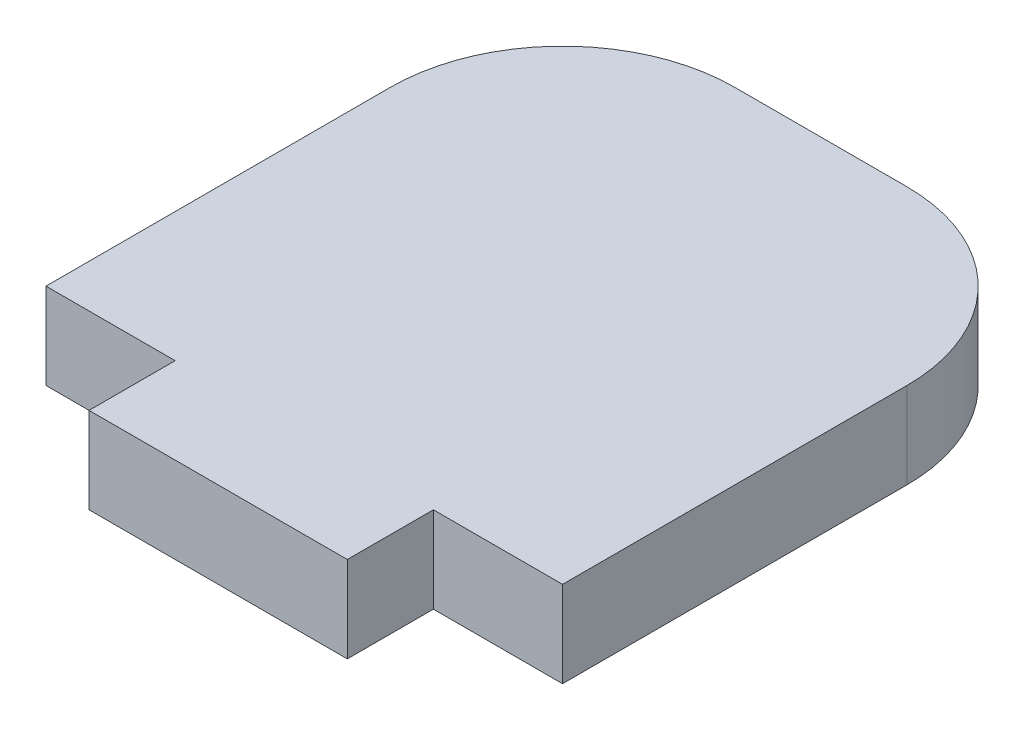
ISO-10303-21;
HEADER;
FILE_DESCRIPTION(('STEP AP214'),'2;1');
FILE_NAME('part.step','',(''),(''),'','','');
FILE_SCHEMA(('AUTOMOTIVE_DESIGN { 1 0 10303 214 1 1 1 1 }'));
ENDSEC;
DATA;
#1=APPLICATION_CONTEXT('core data for automotive mechanical design processes');
#2=APPLICATION_PROTOCOL_DEFINITION('international standard','automotive_design',2000,#1);
#3=PRODUCT_CONTEXT('',#1,'mechanical');
#4=PRODUCT('Part','Part','',(#3));
#5=PRODUCT_RELATED_PRODUCT_CATEGORY('part','',(#4));
#6=PRODUCT_DEFINITION_FORMATION('','',#4);
#7=PRODUCT_DEFINITION_CONTEXT('part definition',#1,'design');
#8=PRODUCT_DEFINITION('design','',#6,#7);
#9=PRODUCT_DEFINITION_SHAPE('','',#8);
#10=(LENGTH_UNIT() NAMED_UNIT(*) SI_UNIT(.MILLI.,.METRE.));
#11=(NAMED_UNIT(*) PLANE_ANGLE_UNIT() SI_UNIT($,.RADIAN.));
#12=(NAMED_UNIT(*) SI_UNIT($,.STERADIAN.) SOLID_ANGLE_UNIT());
#13=UNCERTAINTY_MEASURE_WITH_UNIT(LENGTH_MEASURE(1.E-05),#10,'distance_accuracy_value','');
#14=(GEOMETRIC_REPRESENTATION_CONTEXT(3) GLOBAL_UNCERTAINTY_ASSIGNED_CONTEXT((#13)) GLOBAL_UNIT_ASSIGNED_CONTEXT((#10,
#11,#12)) REPRESENTATION_CONTEXT('',''));
#15=CARTESIAN_POINT('',(0.,0.,0.));
#16=DIRECTION('',(0.,0.,1.));
#17=DIRECTION('',(1.,0.,0.));
#18=AXIS2_PLACEMENT_3D('',#15,#16,#17);
#19=CARTESIAN_POINT('',(-19.05,6.35,-3.175));
#20=DIRECTION('',(0.,0.,-1.));
#21=DIRECTION('',(-1.,0.,0.));
#22=AXIS2_PLACEMENT_3D('',#19,#20,#21);
#23=PLANE('',#22);
#24=DIRECTION('',(1.,0.,0.));
#25=VECTOR('',#24,1.);
#26=CARTESIAN_POINT('',(-19.05,0.,-3.175));
#27=LINE('',#26,#25);
#28=CARTESIAN_POINT('',(-19.05,0.,-3.175));
#29=VERTEX_POINT('',#28);
#30=CARTESIAN_POINT('',(-9.525,0.,-3.175));
#31=VERTEX_POINT('',#30);
#32=EDGE_CURVE('E142',#29,#31,#27,.T.);
#33=ORIENTED_EDGE('',*,*,#32,.T.);
#34=DIRECTION('',(0.,-1.,0.));
#35=VECTOR('',#34,1.);
#36=CARTESIAN_POINT('',(-9.525,6.35,-3.175));
#37=LINE('',#36,#35);
#38=CARTESIAN_POINT('',(-9.525,6.35,-3.175));
#39=VERTEX_POINT('',#38);
#40=EDGE_CURVE('E11',#39,#31,#37,.T.);
#41=ORIENTED_EDGE('',*,*,#40,.F.);
#42=DIRECTION('',(1.,0.,0.));
#43=VECTOR('',#42,1.);
#44=CARTESIAN_POINT('',(-19.05,6.35,-3.175));
#45=LINE('',#44,#43);
#46=CARTESIAN_POINT('',(-19.05,6.35,-3.175));
#47=VERTEX_POINT('',#46);
#48=EDGE_CURVE('E160',#47,#39,#45,.T.);
#49=ORIENTED_EDGE('',*,*,#48,.F.);
#50=DIRECTION('',(0.,-1.,0.));
#51=VECTOR('',#50,1.);
#52=CARTESIAN_POINT('',(-19.05,6.35,-3.175));
#53=LINE('',#52,#51);
#54=EDGE_CURVE('E138',#47,#29,#53,.T.);
#55=ORIENTED_EDGE('',*,*,#54,.T.);
#56=EDGE_LOOP('',(#33,#41,#49,#55));
#57=FACE_BOUND('',#56,.T.);
#58=ADVANCED_FACE('F34',(#57),#23,.F.);
#59=CARTESIAN_POINT('',(-9.525,6.35,3.175));
#60=DIRECTION('',(1.,0.,0.));
#61=DIRECTION('',(0.,0.,-1.));
#62=AXIS2_PLACEMENT_3D('',#59,#60,#61);
#63=PLANE('',#62);
#64=DIRECTION('',(0.,0.,1.));
#65=VECTOR('',#64,1.);
#66=CARTESIAN_POINT('',(-9.525,0.,3.175));
#67=LINE('',#66,#65);
#68=CARTESIAN_POINT('',(-9.525,0.,3.175));
#69=VERTEX_POINT('',#68);
#70=EDGE_CURVE('E145',#31,#69,#67,.T.);
#71=ORIENTED_EDGE('',*,*,#70,.T.);
#72=DIRECTION('',(0.,-1.,0.));
#73=VECTOR('',#72,1.);
#74=CARTESIAN_POINT('',(-9.525,6.35,3.175));
#75=LINE('',#74,#73);
#76=CARTESIAN_POINT('',(-9.525,6.35,3.175));
#77=VERTEX_POINT('',#76);
#78=EDGE_CURVE('E42',#77,#69,#75,.T.);
#79=ORIENTED_EDGE('',*,*,#78,.F.);
#80=DIRECTION('',(0.,0.,1.));
#81=VECTOR('',#80,1.);
#82=CARTESIAN_POINT('',(-9.525,6.35,3.175));
#83=LINE('',#82,#81);
#84=EDGE_CURVE('E99',#39,#77,#83,.T.);
#85=ORIENTED_EDGE('',*,*,#84,.F.);
#86=ORIENTED_EDGE('',*,*,#40,.T.);
#87=EDGE_LOOP('',(#71,#79,#85,#86));
#88=FACE_BOUND('',#87,.T.);
#89=ADVANCED_FACE('F209',(#88),#63,.F.);
#90=CARTESIAN_POINT('',(9.525,6.35,3.175));
#91=DIRECTION('',(0.,0.,-1.));
#92=DIRECTION('',(-1.,0.,0.));
#93=AXIS2_PLACEMENT_3D('',#90,#91,#92);
#94=PLANE('',#93);
#95=DIRECTION('',(1.,0.,0.));
#96=VECTOR('',#95,1.);
#97=CARTESIAN_POINT('',(9.525,0.,3.175));
#98=LINE('',#97,#96);
#99=CARTESIAN_POINT('',(9.525,0.,3.175));
#100=VERTEX_POINT('',#99);
#101=EDGE_CURVE('E147',#69,#100,#98,.T.);
#102=ORIENTED_EDGE('',*,*,#101,.T.);
#103=DIRECTION('',(0.,-1.,0.));
#104=VECTOR('',#103,1.);
#105=CARTESIAN_POINT('',(9.525,6.35,3.175));
#106=LINE('',#105,#104);
#107=CARTESIAN_POINT('',(9.525,6.35,3.175));
#108=VERTEX_POINT('',#107);
#109=EDGE_CURVE('E173',#108,#100,#106,.T.);
#110=ORIENTED_EDGE('',*,*,#109,.F.);
#111=DIRECTION('',(1.,0.,0.));
#112=VECTOR('',#111,1.);
#113=CARTESIAN_POINT('',(9.525,6.35,3.175));
#114=LINE('',#113,#112);
#115=EDGE_CURVE('E181',#77,#108,#114,.T.);
#116=ORIENTED_EDGE('',*,*,#115,.F.);
#117=ORIENTED_EDGE('',*,*,#78,.T.);
#118=EDGE_LOOP('',(#102,#110,#116,#117));
#119=FACE_BOUND('',#118,.T.);
#120=ADVANCED_FACE('F179',(#119),#94,.F.);
#121=CARTESIAN_POINT('',(9.525,6.35,3.175));
#122=DIRECTION('',(-1.,0.,0.));
#123=DIRECTION('',(0.,0.,1.));
#124=AXIS2_PLACEMENT_3D('',#121,#122,#123);
#125=PLANE('',#124);
#126=DIRECTION('',(0.,0.,-1.));
#127=VECTOR('',#126,1.);
#128=CARTESIAN_POINT('',(9.525,0.,3.175));
#129=LINE('',#128,#127);
#130=CARTESIAN_POINT('',(9.525,0.,-3.175));
#131=VERTEX_POINT('',#130);
#132=EDGE_CURVE('E149',#100,#131,#129,.T.);
#133=ORIENTED_EDGE('',*,*,#132,.T.);
#134=DIRECTION('',(0.,-1.,0.));
#135=VECTOR('',#134,1.);
#136=CARTESIAN_POINT('',(9.525,6.35,-3.175));
#137=LINE('',#136,#135);
#138=CARTESIAN_POINT('',(9.525,6.35,-3.175));
#139=VERTEX_POINT('',#138);
#140=EDGE_CURVE('E170',#139,#131,#137,.T.);
#141=ORIENTED_EDGE('',*,*,#140,.F.);
#142=DIRECTION('',(0.,0.,-1.));
#143=VECTOR('',#142,1.);
#144=CARTESIAN_POINT('',(9.525,6.35,3.175));
#145=LINE('',#144,#143);
#146=EDGE_CURVE('E199',#108,#139,#145,.T.);
#147=ORIENTED_EDGE('',*,*,#146,.F.);
#148=ORIENTED_EDGE('',*,*,#109,.T.);
#149=EDGE_LOOP('',(#133,#141,#147,#148));
#150=FACE_BOUND('',#149,.T.);
#151=ADVANCED_FACE('F190',(#150),#125,.F.);
#152=CARTESIAN_POINT('',(9.525,6.35,-3.175));
#153=DIRECTION('',(0.,0.,-1.));
#154=DIRECTION('',(-1.,0.,0.));
#155=AXIS2_PLACEMENT_3D('',#152,#153,#154);
#156=PLANE('',#155);
#157=DIRECTION('',(1.,0.,0.));
#158=VECTOR('',#157,1.);
#159=CARTESIAN_POINT('',(9.525,0.,-3.175));
#160=LINE('',#159,#158);
#161=CARTESIAN_POINT('',(19.05,0.,-3.17500000000001));
#162=VERTEX_POINT('',#161);
#163=EDGE_CURVE('E151',#131,#162,#160,.T.);
#164=ORIENTED_EDGE('',*,*,#163,.T.);
#165=DIRECTION('',(0.,-1.,0.));
#166=VECTOR('',#165,1.);
#167=CARTESIAN_POINT('',(19.05,6.35,-3.17500000000001));
#168=LINE('',#167,#166);
#169=CARTESIAN_POINT('',(19.05,6.35,-3.17500000000001));
#170=VERTEX_POINT('',#169);
#171=EDGE_CURVE('E167',#170,#162,#168,.T.);
#172=ORIENTED_EDGE('',*,*,#171,.F.);
#173=DIRECTION('',(1.,0.,0.));
#174=VECTOR('',#173,1.);
#175=CARTESIAN_POINT('',(9.525,6.35,-3.175));
#176=LINE('',#175,#174);
#177=EDGE_CURVE('E196',#139,#170,#176,.T.);
#178=ORIENTED_EDGE('',*,*,#177,.F.);
#179=ORIENTED_EDGE('',*,*,#140,.T.);
#180=EDGE_LOOP('',(#164,#172,#178,#179));
#181=FACE_BOUND('',#180,.T.);
#182=ADVANCED_FACE('F194',(#181),#156,.F.);
#183=CARTESIAN_POINT('',(19.05,6.35,-3.17500000000001));
#184=DIRECTION('',(-1.,0.,0.));
#185=DIRECTION('',(0.,0.,1.));
#186=AXIS2_PLACEMENT_3D('',#183,#184,#185);
#187=PLANE('',#186);
#188=DIRECTION('',(0.,0.,-1.));
#189=VECTOR('',#188,1.);
#190=CARTESIAN_POINT('',(19.05,0.,-3.17500000000001));
#191=LINE('',#190,#189);
#192=CARTESIAN_POINT('',(19.05,0.,-28.575));
#193=VERTEX_POINT('',#192);
#194=EDGE_CURVE('E153',#162,#193,#191,.T.);
#195=ORIENTED_EDGE('',*,*,#194,.T.);
#196=DIRECTION('',(0.,-1.,0.));
#197=VECTOR('',#196,1.);
#198=CARTESIAN_POINT('',(19.05,6.35,-28.575));
#199=LINE('',#198,#197);
#200=CARTESIAN_POINT('',(19.05,6.35,-28.575));
#201=VERTEX_POINT('',#200);
#202=EDGE_CURVE('E164',#201,#193,#199,.T.);
#203=ORIENTED_EDGE('',*,*,#202,.F.);
#204=DIRECTION('',(0.,0.,-1.));
#205=VECTOR('',#204,1.);
#206=CARTESIAN_POINT('',(19.05,6.35,-3.17500000000001));
#207=LINE('',#206,#205);
#208=EDGE_CURVE('E198',#170,#201,#207,.T.);
#209=ORIENTED_EDGE('',*,*,#208,.F.);
#210=ORIENTED_EDGE('',*,*,#171,.T.);
#211=EDGE_LOOP('',(#195,#203,#209,#210));
#212=FACE_BOUND('',#211,.T.);
#213=ADVANCED_FACE('F221',(#212),#187,.F.);
#214=CARTESIAN_POINT('',(6.35000000000002,6.35,-28.575));
#215=DIRECTION('',(0.,-1.,0.));
#216=DIRECTION('',(0.,0.,-1.));
#217=AXIS2_PLACEMENT_3D('',#214,#215,#216);
#218=CYLINDRICAL_SURFACE('',#217,12.7);
#219=CARTESIAN_POINT('',(6.35000000000002,0.,-28.575));
#220=DIRECTION('',(0.,1.,0.));
#221=DIRECTION('',(0.,0.,-1.));
#222=AXIS2_PLACEMENT_3D('',#219,#220,#221);
#223=CIRCLE('',#222,12.7);
#224=CARTESIAN_POINT('',(6.35000000000001,0.,-41.275));
#225=VERTEX_POINT('',#224);
#226=EDGE_CURVE('E155',#193,#225,#223,.T.);
#227=ORIENTED_EDGE('',*,*,#226,.T.);
#228=DIRECTION('',(0.,-1.,0.));
#229=VECTOR('',#228,1.);
#230=CARTESIAN_POINT('',(6.35000000000001,6.35,-41.275));
#231=LINE('',#230,#229);
#232=CARTESIAN_POINT('',(6.35000000000001,6.35,-41.275));
#233=VERTEX_POINT('',#232);
#234=EDGE_CURVE('E133',#233,#225,#231,.T.);
#235=ORIENTED_EDGE('',*,*,#234,.F.);
#236=CARTESIAN_POINT('',(6.35000000000002,6.35,-28.575));
#237=DIRECTION('',(0.,1.,0.));
#238=DIRECTION('',(0.,0.,-1.));
#239=AXIS2_PLACEMENT_3D('',#236,#237,#238);
#240=CIRCLE('',#239,12.7);
#241=EDGE_CURVE('E124',#201,#233,#240,.T.);
#242=ORIENTED_EDGE('',*,*,#241,.F.);
#243=ORIENTED_EDGE('',*,*,#202,.T.);
#244=EDGE_LOOP('',(#227,#235,#242,#243));
#245=FACE_BOUND('',#244,.T.);
#246=ADVANCED_FACE('F224',(#245),#218,.T.);
#247=CARTESIAN_POINT('',(-6.35000000000002,6.35,-41.275));
#248=DIRECTION('',(0.,0.,1.));
#249=DIRECTION('',(1.,0.,0.));
#250=AXIS2_PLACEMENT_3D('',#247,#248,#249);
#251=PLANE('',#250);
#252=DIRECTION('',(-1.,0.,0.));
#253=VECTOR('',#252,1.);
#254=CARTESIAN_POINT('',(-6.35000000000002,0.,-41.275));
#255=LINE('',#254,#253);
#256=CARTESIAN_POINT('',(-6.35000000000002,0.,-41.275));
#257=VERTEX_POINT('',#256);
#258=EDGE_CURVE('E132',#225,#257,#255,.T.);
#259=ORIENTED_EDGE('',*,*,#258,.T.);
#260=DIRECTION('',(0.,-1.,0.));
#261=VECTOR('',#260,1.);
#262=CARTESIAN_POINT('',(-6.35000000000002,6.35,-41.275));
#263=LINE('',#262,#261);
#264=CARTESIAN_POINT('',(-6.35000000000002,6.35,-41.275));
#265=VERTEX_POINT('',#264);
#266=EDGE_CURVE('E129',#265,#257,#263,.T.);
#267=ORIENTED_EDGE('',*,*,#266,.F.);
#268=DIRECTION('',(-1.,0.,0.));
#269=VECTOR('',#268,1.);
#270=CARTESIAN_POINT('',(-6.35000000000002,6.35,-41.275));
#271=LINE('',#270,#269);
#272=EDGE_CURVE('E118',#233,#265,#271,.T.);
#273=ORIENTED_EDGE('',*,*,#272,.F.);
#274=ORIENTED_EDGE('',*,*,#234,.T.);
#275=EDGE_LOOP('',(#259,#267,#273,#274));
#276=FACE_BOUND('',#275,.T.);
#277=ADVANCED_FACE('F130',(#276),#251,.F.);
#278=CARTESIAN_POINT('',(-6.35000000000002,6.35,-28.575));
#279=DIRECTION('',(0.,-1.,0.));
#280=DIRECTION('',(0.,0.,-1.));
#281=AXIS2_PLACEMENT_3D('',#278,#279,#280);
#282=CYLINDRICAL_SURFACE('',#281,12.7);
#283=CARTESIAN_POINT('',(-6.35000000000002,0.,-28.575));
#284=DIRECTION('',(0.,1.,0.));
#285=DIRECTION('',(0.,0.,-1.));
#286=AXIS2_PLACEMENT_3D('',#283,#284,#285);
#287=CIRCLE('',#286,12.7);
#288=CARTESIAN_POINT('',(-19.05,0.,-28.575));
#289=VERTEX_POINT('',#288);
#290=EDGE_CURVE('E85',#257,#289,#287,.T.);
#291=ORIENTED_EDGE('',*,*,#290,.T.);
#292=DIRECTION('',(0.,-1.,0.));
#293=VECTOR('',#292,1.);
#294=CARTESIAN_POINT('',(-19.05,6.35,-28.575));
#295=LINE('',#294,#293);
#296=CARTESIAN_POINT('',(-19.05,6.35,-28.575));
#297=VERTEX_POINT('',#296);
#298=EDGE_CURVE('E134',#297,#289,#295,.T.);
#299=ORIENTED_EDGE('',*,*,#298,.F.);
#300=CARTESIAN_POINT('',(-6.35000000000002,6.35,-28.575));
#301=DIRECTION('',(0.,1.,0.));
#302=DIRECTION('',(0.,0.,-1.));
#303=AXIS2_PLACEMENT_3D('',#300,#301,#302);
#304=CIRCLE('',#303,12.7);
#305=EDGE_CURVE('E122',#265,#297,#304,.T.);
#306=ORIENTED_EDGE('',*,*,#305,.F.);
#307=ORIENTED_EDGE('',*,*,#266,.T.);
#308=EDGE_LOOP('',(#291,#299,#306,#307));
#309=FACE_BOUND('',#308,.T.);
#310=ADVANCED_FACE('F136',(#309),#282,.T.);
#311=CARTESIAN_POINT('',(-19.05,6.35,-3.175));
#312=DIRECTION('',(1.,0.,0.));
#313=DIRECTION('',(0.,0.,-1.));
#314=AXIS2_PLACEMENT_3D('',#311,#312,#313);
#315=PLANE('',#314);
#316=DIRECTION('',(0.,0.,1.));
#317=VECTOR('',#316,1.);
#318=CARTESIAN_POINT('',(-19.05,0.,-3.175));
#319=LINE('',#318,#317);
#320=EDGE_CURVE('E91',#289,#29,#319,.T.);
#321=ORIENTED_EDGE('',*,*,#320,.T.);
#322=ORIENTED_EDGE('',*,*,#54,.F.);
#323=DIRECTION('',(0.,0.,1.));
#324=VECTOR('',#323,1.);
#325=CARTESIAN_POINT('',(-19.05,6.35,-3.175));
#326=LINE('',#325,#324);
#327=EDGE_CURVE('E50',#297,#47,#326,.T.);
#328=ORIENTED_EDGE('',*,*,#327,.F.);
#329=ORIENTED_EDGE('',*,*,#298,.T.);
#330=EDGE_LOOP('',(#321,#322,#328,#329));
#331=FACE_BOUND('',#330,.T.);
#332=ADVANCED_FACE('F233',(#331),#315,.F.);
#333=CARTESIAN_POINT('',(6.35000000000002,6.35,-28.575));
#334=DIRECTION('',(0.,-1.,0.));
#335=DIRECTION('',(0.,0.,-1.));
#336=AXIS2_PLACEMENT_3D('',#333,#334,#335);
#337=PLANE('',#336);
#338=ORIENTED_EDGE('',*,*,#48,.T.);
#339=ORIENTED_EDGE('',*,*,#84,.T.);
#340=ORIENTED_EDGE('',*,*,#115,.T.);
#341=ORIENTED_EDGE('',*,*,#146,.T.);
#342=ORIENTED_EDGE('',*,*,#177,.T.);
#343=ORIENTED_EDGE('',*,*,#208,.T.);
#344=ORIENTED_EDGE('',*,*,#241,.T.);
#345=ORIENTED_EDGE('',*,*,#272,.T.);
#346=ORIENTED_EDGE('',*,*,#305,.T.);
#347=ORIENTED_EDGE('',*,*,#327,.T.);
#348=EDGE_LOOP('',(#338,#339,#340,#341,#342,#343,#344,#345,#346,#347));
#349=FACE_BOUND('',#348,.T.);
#350=ADVANCED_FACE('F120',(#349),#337,.F.);
#351=CARTESIAN_POINT('',(6.35000000000002,0.,-28.575));
#352=DIRECTION('',(0.,-1.,0.));
#353=DIRECTION('',(0.,0.,-1.));
#354=AXIS2_PLACEMENT_3D('',#351,#352,#353);
#355=PLANE('',#354);
#356=ORIENTED_EDGE('',*,*,#32,.F.);
#357=ORIENTED_EDGE('',*,*,#320,.F.);
#358=ORIENTED_EDGE('',*,*,#290,.F.);
#359=ORIENTED_EDGE('',*,*,#258,.F.);
#360=ORIENTED_EDGE('',*,*,#226,.F.);
#361=ORIENTED_EDGE('',*,*,#194,.F.);
#362=ORIENTED_EDGE('',*,*,#163,.F.);
#363=ORIENTED_EDGE('',*,*,#132,.F.);
#364=ORIENTED_EDGE('',*,*,#101,.F.);
#365=ORIENTED_EDGE('',*,*,#70,.F.);
#366=EDGE_LOOP('',(#356,#357,#358,#359,#360,#361,#362,#363,#364,#365));
#367=FACE_BOUND('',#366,.T.);
#368=ADVANCED_FACE('F185',(#367),#355,.T.);
#369=CLOSED_SHELL('',(#58,#89,#120,#151,#182,#213,#246,#277,#310,#332,#350,#368));
#370=MANIFOLD_SOLID_BREP('B2',#369);
#371=ADVANCED_BREP_SHAPE_REPRESENTATION('',(#18,#370),#14);
#372=SHAPE_DEFINITION_REPRESENTATION(#9,#371);
ENDSEC;
END-ISO-10303-21;
